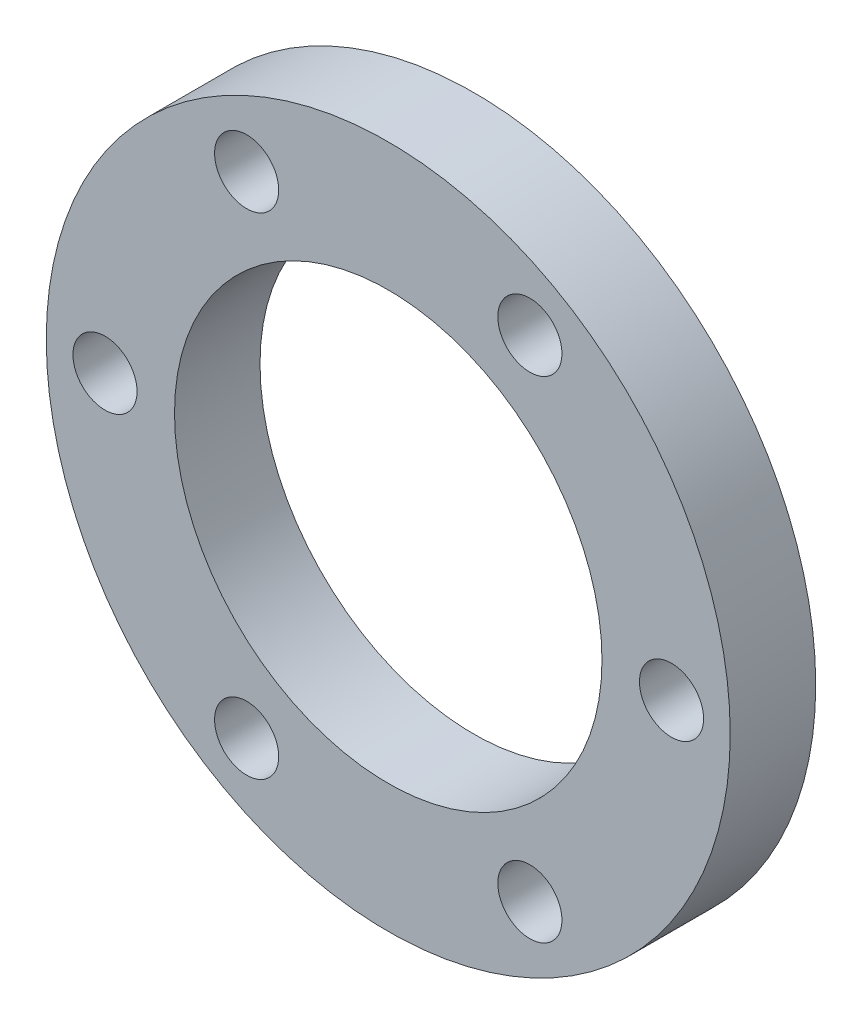
ISO-10303-21;
HEADER;
FILE_DESCRIPTION(('STEP AP214'),'2;1');
FILE_NAME('part.step','',(''),(''),'','','');
FILE_SCHEMA(('AUTOMOTIVE_DESIGN { 1 0 10303 214 1 1 1 1 }'));
ENDSEC;
DATA;
#1=APPLICATION_CONTEXT('core data for automotive mechanical design processes');
#2=APPLICATION_PROTOCOL_DEFINITION('international standard','automotive_design',2000,#1);
#3=PRODUCT_CONTEXT('',#1,'mechanical');
#4=PRODUCT('Part','Part','',(#3));
#5=PRODUCT_RELATED_PRODUCT_CATEGORY('part','',(#4));
#6=PRODUCT_DEFINITION_FORMATION('','',#4);
#7=PRODUCT_DEFINITION_CONTEXT('part definition',#1,'design');
#8=PRODUCT_DEFINITION('design','',#6,#7);
#9=PRODUCT_DEFINITION_SHAPE('','',#8);
#10=(LENGTH_UNIT() NAMED_UNIT(*) SI_UNIT(.MILLI.,.METRE.));
#11=(NAMED_UNIT(*) PLANE_ANGLE_UNIT() SI_UNIT($,.RADIAN.));
#12=(NAMED_UNIT(*) SI_UNIT($,.STERADIAN.) SOLID_ANGLE_UNIT());
#13=UNCERTAINTY_MEASURE_WITH_UNIT(LENGTH_MEASURE(1.E-05),#10,'distance_accuracy_value','');
#14=(GEOMETRIC_REPRESENTATION_CONTEXT(3) GLOBAL_UNCERTAINTY_ASSIGNED_CONTEXT((#13)) GLOBAL_UNIT_ASSIGNED_CONTEXT((#10,
#11,#12)) REPRESENTATION_CONTEXT('',''));
#15=CARTESIAN_POINT('',(0.,0.,0.));
#16=DIRECTION('',(0.,0.,1.));
#17=DIRECTION('',(1.,0.,0.));
#18=AXIS2_PLACEMENT_3D('',#15,#16,#17);
#19=CARTESIAN_POINT('',(0.,0.,20.));
#20=DIRECTION('',(0.,0.,-1.));
#21=DIRECTION('',(-1.,0.,0.));
#22=AXIS2_PLACEMENT_3D('',#19,#20,#21);
#23=CYLINDRICAL_SURFACE('',#22,80.);
#24=CARTESIAN_POINT('',(0.,0.,20.));
#25=DIRECTION('',(0.,0.,1.));
#26=DIRECTION('',(1.,0.,0.));
#27=AXIS2_PLACEMENT_3D('',#24,#25,#26);
#28=CIRCLE('',#27,80.);
#29=CARTESIAN_POINT('',(80.,0.,20.));
#30=VERTEX_POINT('',#29);
#31=EDGE_CURVE('E45',#30,#30,#28,.T.);
#32=ORIENTED_EDGE('',*,*,#31,.F.);
#33=EDGE_LOOP('',(#32));
#34=FACE_BOUND('',#33,.T.);
#35=CARTESIAN_POINT('',(0.,0.,0.));
#36=DIRECTION('',(0.,0.,1.));
#37=DIRECTION('',(1.,0.,0.));
#38=AXIS2_PLACEMENT_3D('',#35,#36,#37);
#39=CIRCLE('',#38,80.);
#40=CARTESIAN_POINT('',(80.,0.,0.));
#41=VERTEX_POINT('',#40);
#42=EDGE_CURVE('E79',#41,#41,#39,.T.);
#43=ORIENTED_EDGE('',*,*,#42,.T.);
#44=EDGE_LOOP('',(#43));
#45=FACE_BOUND('',#44,.T.);
#46=ADVANCED_FACE('F36',(#34,#45),#23,.T.);
#47=CARTESIAN_POINT('',(33.1302503652918,-57.3832769001641,20.));
#48=DIRECTION('',(0.,0.,-1.));
#49=DIRECTION('',(-1.,0.,0.));
#50=AXIS2_PLACEMENT_3D('',#47,#48,#49);
#51=CYLINDRICAL_SURFACE('',#50,7.5);
#52=CARTESIAN_POINT('',(33.1302503652918,-57.3832769001641,20.));
#53=DIRECTION('',(0.,0.,1.));
#54=DIRECTION('',(1.,0.,0.));
#55=AXIS2_PLACEMENT_3D('',#52,#53,#54);
#56=CIRCLE('',#55,7.5);
#57=CARTESIAN_POINT('',(40.6302503652918,-57.3832769001641,20.));
#58=VERTEX_POINT('',#57);
#59=EDGE_CURVE('E52',#58,#58,#56,.T.);
#60=ORIENTED_EDGE('',*,*,#59,.T.);
#61=EDGE_LOOP('',(#60));
#62=FACE_BOUND('',#61,.T.);
#63=CARTESIAN_POINT('',(33.1302503652918,-57.3832769001641,0.));
#64=DIRECTION('',(0.,0.,1.));
#65=DIRECTION('',(1.,0.,0.));
#66=AXIS2_PLACEMENT_3D('',#63,#64,#65);
#67=CIRCLE('',#66,7.5);
#68=CARTESIAN_POINT('',(40.6302503652918,-57.3832769001641,0.));
#69=VERTEX_POINT('',#68);
#70=EDGE_CURVE('E76',#69,#69,#67,.T.);
#71=ORIENTED_EDGE('',*,*,#70,.F.);
#72=EDGE_LOOP('',(#71));
#73=FACE_BOUND('',#72,.T.);
#74=ADVANCED_FACE('F118',(#62,#73),#51,.F.);
#75=CARTESIAN_POINT('',(66.2605007305847,-5.23886489744996E-13,20.));
#76=DIRECTION('',(0.,0.,-1.));
#77=DIRECTION('',(-1.,0.,0.));
#78=AXIS2_PLACEMENT_3D('',#75,#76,#77);
#79=CYLINDRICAL_SURFACE('',#78,7.5);
#80=CARTESIAN_POINT('',(66.2605007305847,-5.23886489744996E-13,20.));
#81=DIRECTION('',(0.,0.,1.));
#82=DIRECTION('',(1.,0.,0.));
#83=AXIS2_PLACEMENT_3D('',#80,#81,#82);
#84=CIRCLE('',#83,7.5);
#85=CARTESIAN_POINT('',(73.7605007305847,-5.23886489744996E-13,20.));
#86=VERTEX_POINT('',#85);
#87=EDGE_CURVE('E110',#86,#86,#84,.T.);
#88=ORIENTED_EDGE('',*,*,#87,.T.);
#89=EDGE_LOOP('',(#88));
#90=FACE_BOUND('',#89,.T.);
#91=CARTESIAN_POINT('',(66.2605007305847,-5.23886489744996E-13,0.));
#92=DIRECTION('',(0.,0.,1.));
#93=DIRECTION('',(1.,0.,0.));
#94=AXIS2_PLACEMENT_3D('',#91,#92,#93);
#95=CIRCLE('',#94,7.5);
#96=CARTESIAN_POINT('',(73.7605007305847,-5.23886489744996E-13,0.));
#97=VERTEX_POINT('',#96);
#98=EDGE_CURVE('E72',#97,#97,#95,.T.);
#99=ORIENTED_EDGE('',*,*,#98,.F.);
#100=EDGE_LOOP('',(#99));
#101=FACE_BOUND('',#100,.T.);
#102=ADVANCED_FACE('F136',(#90,#101),#79,.F.);
#103=CARTESIAN_POINT('',(33.1302503652927,57.3832769001636,20.));
#104=DIRECTION('',(0.,0.,-1.));
#105=DIRECTION('',(-1.,0.,0.));
#106=AXIS2_PLACEMENT_3D('',#103,#104,#105);
#107=CYLINDRICAL_SURFACE('',#106,7.5);
#108=CARTESIAN_POINT('',(33.1302503652927,57.3832769001636,20.));
#109=DIRECTION('',(0.,0.,1.));
#110=DIRECTION('',(1.,0.,0.));
#111=AXIS2_PLACEMENT_3D('',#108,#109,#110);
#112=CIRCLE('',#111,7.5);
#113=CARTESIAN_POINT('',(40.6302503652927,57.3832769001636,20.));
#114=VERTEX_POINT('',#113);
#115=EDGE_CURVE('E106',#114,#114,#112,.T.);
#116=ORIENTED_EDGE('',*,*,#115,.T.);
#117=EDGE_LOOP('',(#116));
#118=FACE_BOUND('',#117,.T.);
#119=CARTESIAN_POINT('',(33.1302503652927,57.3832769001636,0.));
#120=DIRECTION('',(0.,0.,1.));
#121=DIRECTION('',(1.,0.,0.));
#122=AXIS2_PLACEMENT_3D('',#119,#120,#121);
#123=CIRCLE('',#122,7.5);
#124=CARTESIAN_POINT('',(40.6302503652927,57.3832769001636,0.));
#125=VERTEX_POINT('',#124);
#126=EDGE_CURVE('E68',#125,#125,#123,.T.);
#127=ORIENTED_EDGE('',*,*,#126,.F.);
#128=EDGE_LOOP('',(#127));
#129=FACE_BOUND('',#128,.T.);
#130=ADVANCED_FACE('F143',(#118,#129),#107,.F.);
#131=CARTESIAN_POINT('',(-33.1302503652922,57.3832769001638,20.));
#132=DIRECTION('',(0.,0.,-1.));
#133=DIRECTION('',(-1.,0.,0.));
#134=AXIS2_PLACEMENT_3D('',#131,#132,#133);
#135=CYLINDRICAL_SURFACE('',#134,7.49999999999999);
#136=CARTESIAN_POINT('',(-33.1302503652922,57.3832769001638,20.));
#137=DIRECTION('',(0.,0.,1.));
#138=DIRECTION('',(1.,0.,0.));
#139=AXIS2_PLACEMENT_3D('',#136,#137,#138);
#140=CIRCLE('',#139,7.49999999999999);
#141=CARTESIAN_POINT('',(-25.6302503652922,57.3832769001638,20.));
#142=VERTEX_POINT('',#141);
#143=EDGE_CURVE('E100',#142,#142,#140,.T.);
#144=ORIENTED_EDGE('',*,*,#143,.T.);
#145=EDGE_LOOP('',(#144));
#146=FACE_BOUND('',#145,.T.);
#147=CARTESIAN_POINT('',(-33.1302503652922,57.3832769001638,0.));
#148=DIRECTION('',(0.,0.,1.));
#149=DIRECTION('',(1.,0.,0.));
#150=AXIS2_PLACEMENT_3D('',#147,#148,#149);
#151=CIRCLE('',#150,7.49999999999999);
#152=CARTESIAN_POINT('',(-25.6302503652922,57.3832769001638,0.));
#153=VERTEX_POINT('',#152);
#154=EDGE_CURVE('E64',#153,#153,#151,.T.);
#155=ORIENTED_EDGE('',*,*,#154,.F.);
#156=EDGE_LOOP('',(#155));
#157=FACE_BOUND('',#156,.T.);
#158=ADVANCED_FACE('F147',(#146,#157),#135,.F.);
#159=CARTESIAN_POINT('',(-66.2605007305847,0.,20.));
#160=DIRECTION('',(0.,0.,-1.));
#161=DIRECTION('',(-1.,0.,0.));
#162=AXIS2_PLACEMENT_3D('',#159,#160,#161);
#163=CYLINDRICAL_SURFACE('',#162,7.5);
#164=CARTESIAN_POINT('',(-66.2605007305847,0.,20.));
#165=DIRECTION('',(0.,0.,1.));
#166=DIRECTION('',(1.,0.,0.));
#167=AXIS2_PLACEMENT_3D('',#164,#165,#166);
#168=CIRCLE('',#167,7.5);
#169=CARTESIAN_POINT('',(-58.7605007305847,0.,20.));
#170=VERTEX_POINT('',#169);
#171=EDGE_CURVE('E93',#170,#170,#168,.T.);
#172=ORIENTED_EDGE('',*,*,#171,.T.);
#173=EDGE_LOOP('',(#172));
#174=FACE_BOUND('',#173,.T.);
#175=CARTESIAN_POINT('',(-66.2605007305847,0.,0.));
#176=DIRECTION('',(0.,0.,1.));
#177=DIRECTION('',(1.,0.,0.));
#178=AXIS2_PLACEMENT_3D('',#175,#176,#177);
#179=CIRCLE('',#178,7.5);
#180=CARTESIAN_POINT('',(-58.7605007305847,0.,0.));
#181=VERTEX_POINT('',#180);
#182=EDGE_CURVE('E60',#181,#181,#179,.T.);
#183=ORIENTED_EDGE('',*,*,#182,.F.);
#184=EDGE_LOOP('',(#183));
#185=FACE_BOUND('',#184,.T.);
#186=ADVANCED_FACE('F150',(#174,#185),#163,.F.);
#187=CARTESIAN_POINT('',(-33.1302503652931,-57.3832769001633,20.));
#188=DIRECTION('',(0.,0.,-1.));
#189=DIRECTION('',(-1.,0.,0.));
#190=AXIS2_PLACEMENT_3D('',#187,#188,#189);
#191=CYLINDRICAL_SURFACE('',#190,7.50000000000001);
#192=CARTESIAN_POINT('',(-33.1302503652931,-57.3832769001633,20.));
#193=DIRECTION('',(0.,0.,1.));
#194=DIRECTION('',(1.,0.,0.));
#195=AXIS2_PLACEMENT_3D('',#192,#193,#194);
#196=CIRCLE('',#195,7.50000000000001);
#197=CARTESIAN_POINT('',(-25.6302503652931,-57.3832769001633,20.));
#198=VERTEX_POINT('',#197);
#199=EDGE_CURVE('E87',#198,#198,#196,.T.);
#200=ORIENTED_EDGE('',*,*,#199,.T.);
#201=EDGE_LOOP('',(#200));
#202=FACE_BOUND('',#201,.T.);
#203=CARTESIAN_POINT('',(-33.1302503652931,-57.3832769001633,0.));
#204=DIRECTION('',(0.,0.,1.));
#205=DIRECTION('',(1.,0.,0.));
#206=AXIS2_PLACEMENT_3D('',#203,#204,#205);
#207=CIRCLE('',#206,7.50000000000001);
#208=CARTESIAN_POINT('',(-25.6302503652931,-57.3832769001633,0.));
#209=VERTEX_POINT('',#208);
#210=EDGE_CURVE('E56',#209,#209,#207,.T.);
#211=ORIENTED_EDGE('',*,*,#210,.F.);
#212=EDGE_LOOP('',(#211));
#213=FACE_BOUND('',#212,.T.);
#214=ADVANCED_FACE('F38',(#202,#213),#191,.F.);
#215=CARTESIAN_POINT('',(0.,0.,20.));
#216=DIRECTION('',(0.,0.,-1.));
#217=DIRECTION('',(-1.,0.,0.));
#218=AXIS2_PLACEMENT_3D('',#215,#216,#217);
#219=CYLINDRICAL_SURFACE('',#218,50.);
#220=CARTESIAN_POINT('',(0.,0.,20.));
#221=DIRECTION('',(0.,0.,1.));
#222=DIRECTION('',(1.,0.,0.));
#223=AXIS2_PLACEMENT_3D('',#220,#221,#222);
#224=CIRCLE('',#223,50.);
#225=CARTESIAN_POINT('',(50.,0.,20.));
#226=VERTEX_POINT('',#225);
#227=EDGE_CURVE('E10',#226,#226,#224,.T.);
#228=ORIENTED_EDGE('',*,*,#227,.T.);
#229=EDGE_LOOP('',(#228));
#230=FACE_BOUND('',#229,.T.);
#231=CARTESIAN_POINT('',(0.,0.,0.));
#232=DIRECTION('',(0.,0.,1.));
#233=DIRECTION('',(1.,0.,0.));
#234=AXIS2_PLACEMENT_3D('',#231,#232,#233);
#235=CIRCLE('',#234,50.);
#236=CARTESIAN_POINT('',(50.,0.,0.));
#237=VERTEX_POINT('',#236);
#238=EDGE_CURVE('E40',#237,#237,#235,.T.);
#239=ORIENTED_EDGE('',*,*,#238,.F.);
#240=EDGE_LOOP('',(#239));
#241=FACE_BOUND('',#240,.T.);
#242=ADVANCED_FACE('F125',(#230,#241),#219,.F.);
#243=CARTESIAN_POINT('',(0.,0.,20.));
#244=DIRECTION('',(0.,0.,1.));
#245=DIRECTION('',(1.,0.,0.));
#246=AXIS2_PLACEMENT_3D('',#243,#244,#245);
#247=PLANE('',#246);
#248=ORIENTED_EDGE('',*,*,#199,.F.);
#249=EDGE_LOOP('',(#248));
#250=FACE_BOUND('',#249,.T.);
#251=ORIENTED_EDGE('',*,*,#171,.F.);
#252=EDGE_LOOP('',(#251));
#253=FACE_BOUND('',#252,.T.);
#254=ORIENTED_EDGE('',*,*,#143,.F.);
#255=EDGE_LOOP('',(#254));
#256=FACE_BOUND('',#255,.T.);
#257=ORIENTED_EDGE('',*,*,#115,.F.);
#258=EDGE_LOOP('',(#257));
#259=FACE_BOUND('',#258,.T.);
#260=ORIENTED_EDGE('',*,*,#87,.F.);
#261=EDGE_LOOP('',(#260));
#262=FACE_BOUND('',#261,.T.);
#263=ORIENTED_EDGE('',*,*,#59,.F.);
#264=EDGE_LOOP('',(#263));
#265=FACE_BOUND('',#264,.T.);
#266=ORIENTED_EDGE('',*,*,#31,.T.);
#267=EDGE_LOOP('',(#266));
#268=FACE_BOUND('',#267,.T.);
#269=ORIENTED_EDGE('',*,*,#227,.F.);
#270=EDGE_LOOP('',(#269));
#271=FACE_BOUND('',#270,.T.);
#272=ADVANCED_FACE('F121',(#250,#253,#256,#259,#262,#265,#268,#271),#247,.T.);
#273=CARTESIAN_POINT('',(0.,0.,0.));
#274=DIRECTION('',(0.,0.,1.));
#275=DIRECTION('',(1.,0.,0.));
#276=AXIS2_PLACEMENT_3D('',#273,#274,#275);
#277=PLANE('',#276);
#278=ORIENTED_EDGE('',*,*,#210,.T.);
#279=EDGE_LOOP('',(#278));
#280=FACE_BOUND('',#279,.T.);
#281=ORIENTED_EDGE('',*,*,#182,.T.);
#282=EDGE_LOOP('',(#281));
#283=FACE_BOUND('',#282,.T.);
#284=ORIENTED_EDGE('',*,*,#154,.T.);
#285=EDGE_LOOP('',(#284));
#286=FACE_BOUND('',#285,.T.);
#287=ORIENTED_EDGE('',*,*,#126,.T.);
#288=EDGE_LOOP('',(#287));
#289=FACE_BOUND('',#288,.T.);
#290=ORIENTED_EDGE('',*,*,#98,.T.);
#291=EDGE_LOOP('',(#290));
#292=FACE_BOUND('',#291,.T.);
#293=ORIENTED_EDGE('',*,*,#70,.T.);
#294=EDGE_LOOP('',(#293));
#295=FACE_BOUND('',#294,.T.);
#296=ORIENTED_EDGE('',*,*,#42,.F.);
#297=EDGE_LOOP('',(#296));
#298=FACE_BOUND('',#297,.T.);
#299=ORIENTED_EDGE('',*,*,#238,.T.);
#300=EDGE_LOOP('',(#299));
#301=FACE_BOUND('',#300,.T.);
#302=ADVANCED_FACE('F124',(#280,#283,#286,#289,#292,#295,#298,#301),#277,.F.);
#303=CLOSED_SHELL('',(#46,#74,#102,#130,#158,#186,#214,#242,#272,#302));
#304=MANIFOLD_SOLID_BREP('B2',#303);
#305=ADVANCED_BREP_SHAPE_REPRESENTATION('',(#18,#304),#14);
#306=SHAPE_DEFINITION_REPRESENTATION(#9,#305);
ENDSEC;
END-ISO-10303-21;
